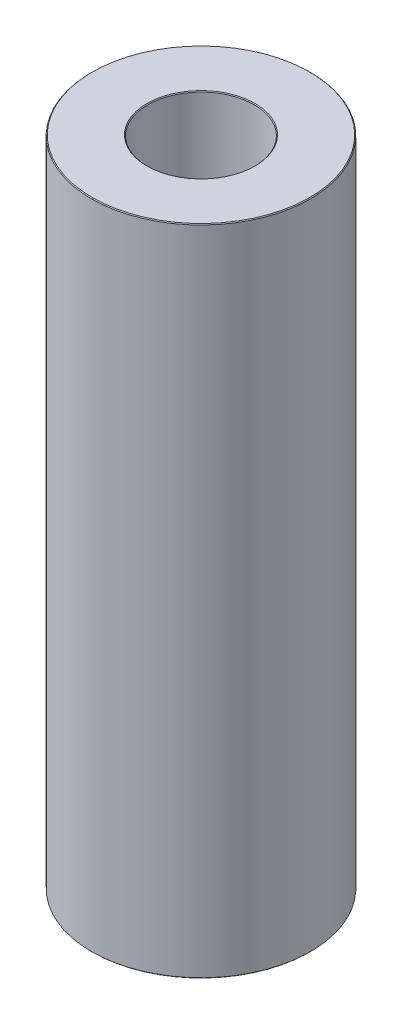
ISO-10303-21;
HEADER;
FILE_DESCRIPTION(('STEP AP214'),'2;1');
FILE_NAME('part.step','',(''),(''),'','','');
FILE_SCHEMA(('AUTOMOTIVE_DESIGN { 1 0 10303 214 1 1 1 1 }'));
ENDSEC;
DATA;
#1=APPLICATION_CONTEXT('core data for automotive mechanical design processes');
#2=APPLICATION_PROTOCOL_DEFINITION('international standard','automotive_design',2000,#1);
#3=PRODUCT_CONTEXT('',#1,'mechanical');
#4=PRODUCT('Part','Part','',(#3));
#5=PRODUCT_RELATED_PRODUCT_CATEGORY('part','',(#4));
#6=PRODUCT_DEFINITION_FORMATION('','',#4);
#7=PRODUCT_DEFINITION_CONTEXT('part definition',#1,'design');
#8=PRODUCT_DEFINITION('design','',#6,#7);
#9=PRODUCT_DEFINITION_SHAPE('','',#8);
#10=(LENGTH_UNIT() NAMED_UNIT(*) SI_UNIT(.MILLI.,.METRE.));
#11=(NAMED_UNIT(*) PLANE_ANGLE_UNIT() SI_UNIT($,.RADIAN.));
#12=(NAMED_UNIT(*) SI_UNIT($,.STERADIAN.) SOLID_ANGLE_UNIT());
#13=UNCERTAINTY_MEASURE_WITH_UNIT(LENGTH_MEASURE(1.E-05),#10,'distance_accuracy_value','');
#14=(GEOMETRIC_REPRESENTATION_CONTEXT(3) GLOBAL_UNCERTAINTY_ASSIGNED_CONTEXT((#13)) GLOBAL_UNIT_ASSIGNED_CONTEXT((#10,
#11,#12)) REPRESENTATION_CONTEXT('',''));
#15=CARTESIAN_POINT('',(0.,0.,0.));
#16=DIRECTION('',(0.,0.,1.));
#17=DIRECTION('',(1.,0.,0.));
#18=AXIS2_PLACEMENT_3D('',#15,#16,#17);
#19=CARTESIAN_POINT('',(0.,298.431814480099,0.));
#20=DIRECTION('',(0.,-1.,0.));
#21=DIRECTION('',(0.,0.,-1.));
#22=AXIS2_PLACEMENT_3D('',#19,#20,#21);
#23=CYLINDRICAL_SURFACE('',#22,50.);
#24=CARTESIAN_POINT('',(0.,0.345083715051486,0.));
#25=DIRECTION('',(0.,1.,0.));
#26=DIRECTION('',(0.,0.,1.));
#27=AXIS2_PLACEMENT_3D('',#24,#25,#26);
#28=CIRCLE('',#27,50.);
#29=CARTESIAN_POINT('',(0.,0.345083715051486,50.));
#30=VERTEX_POINT('',#29);
#31=EDGE_CURVE('E10',#30,#30,#28,.T.);
#32=ORIENTED_EDGE('',*,*,#31,.T.);
#33=EDGE_LOOP('',(#32));
#34=FACE_BOUND('',#33,.T.);
#35=CARTESIAN_POINT('',(0.,298.086730765048,0.));
#36=DIRECTION('',(0.,1.,0.));
#37=DIRECTION('',(0.,0.,1.));
#38=AXIS2_PLACEMENT_3D('',#35,#36,#37);
#39=CIRCLE('',#38,50.);
#40=CARTESIAN_POINT('',(0.,298.086730765048,50.));
#41=VERTEX_POINT('',#40);
#42=EDGE_CURVE('E50',#41,#41,#39,.F.);
#43=ORIENTED_EDGE('',*,*,#42,.T.);
#44=EDGE_LOOP('',(#43));
#45=FACE_BOUND('',#44,.T.);
#46=ADVANCED_FACE('F39',(#34,#45),#23,.T.);
#47=CARTESIAN_POINT('',(0.,298.431814480099,0.));
#48=DIRECTION('',(0.,1.,0.));
#49=DIRECTION('',(0.,0.,1.));
#50=AXIS2_PLACEMENT_3D('',#47,#48,#49);
#51=PLANE('',#50);
#52=CARTESIAN_POINT('',(0.,298.431814480099,0.));
#53=DIRECTION('',(0.,1.,0.));
#54=DIRECTION('',(0.,0.,1.));
#55=AXIS2_PLACEMENT_3D('',#52,#53,#54);
#56=CIRCLE('',#55,24.7235383543607);
#57=CARTESIAN_POINT('',(0.,298.431814480099,24.7235383543607));
#58=VERTEX_POINT('',#57);
#59=EDGE_CURVE('E58',#58,#58,#56,.F.);
#60=ORIENTED_EDGE('',*,*,#59,.T.);
#61=EDGE_LOOP('',(#60));
#62=FACE_BOUND('',#61,.T.);
#63=CARTESIAN_POINT('',(0.,298.431814480099,0.));
#64=DIRECTION('',(0.,1.,0.));
#65=DIRECTION('',(0.,0.,1.));
#66=AXIS2_PLACEMENT_3D('',#63,#64,#65);
#67=CIRCLE('',#66,49.6549162849484);
#68=CARTESIAN_POINT('',(0.,298.431814480099,49.6549162849484));
#69=VERTEX_POINT('',#68);
#70=EDGE_CURVE('E61',#69,#69,#67,.T.);
#71=ORIENTED_EDGE('',*,*,#70,.T.);
#72=EDGE_LOOP('',(#71));
#73=FACE_BOUND('',#72,.T.);
#74=ADVANCED_FACE('F88',(#62,#73),#51,.T.);
#75=CARTESIAN_POINT('',(0.,0.,0.));
#76=DIRECTION('',(0.,1.,0.));
#77=DIRECTION('',(0.,0.,1.));
#78=AXIS2_PLACEMENT_3D('',#75,#76,#77);
#79=PLANE('',#78);
#80=CARTESIAN_POINT('',(0.,0.,0.));
#81=DIRECTION('',(0.,1.,0.));
#82=DIRECTION('',(0.,0.,1.));
#83=AXIS2_PLACEMENT_3D('',#80,#81,#82);
#84=CIRCLE('',#83,24.7235383543607);
#85=CARTESIAN_POINT('',(0.,0.,24.7235383543607));
#86=VERTEX_POINT('',#85);
#87=EDGE_CURVE('E51',#86,#86,#84,.T.);
#88=ORIENTED_EDGE('',*,*,#87,.T.);
#89=EDGE_LOOP('',(#88));
#90=FACE_BOUND('',#89,.T.);
#91=CARTESIAN_POINT('',(0.,0.,0.));
#92=DIRECTION('',(0.,1.,0.));
#93=DIRECTION('',(0.,0.,1.));
#94=AXIS2_PLACEMENT_3D('',#91,#92,#93);
#95=CIRCLE('',#94,49.6549162849485);
#96=CARTESIAN_POINT('',(0.,0.,49.6549162849485));
#97=VERTEX_POINT('',#96);
#98=EDGE_CURVE('E54',#97,#97,#95,.F.);
#99=ORIENTED_EDGE('',*,*,#98,.T.);
#100=EDGE_LOOP('',(#99));
#101=FACE_BOUND('',#100,.T.);
#102=ADVANCED_FACE('F83',(#90,#101),#79,.F.);
#103=CARTESIAN_POINT('',(0.,298.431814480099,0.));
#104=DIRECTION('',(0.,-1.,0.));
#105=DIRECTION('',(0.,0.,-1.));
#106=AXIS2_PLACEMENT_3D('',#103,#104,#105);
#107=CYLINDRICAL_SURFACE('',#106,24.3784546393093);
#108=CARTESIAN_POINT('',(0.,298.086730765048,0.));
#109=DIRECTION('',(0.,1.,0.));
#110=DIRECTION('',(0.,0.,1.));
#111=AXIS2_PLACEMENT_3D('',#108,#109,#110);
#112=CIRCLE('',#111,24.3784546393093);
#113=CARTESIAN_POINT('',(0.,298.086730765048,24.3784546393093));
#114=VERTEX_POINT('',#113);
#115=EDGE_CURVE('E67',#114,#114,#112,.T.);
#116=ORIENTED_EDGE('',*,*,#115,.T.);
#117=EDGE_LOOP('',(#116));
#118=FACE_BOUND('',#117,.T.);
#119=CARTESIAN_POINT('',(0.,0.345083715051486,0.));
#120=DIRECTION('',(0.,1.,0.));
#121=DIRECTION('',(0.,0.,1.));
#122=AXIS2_PLACEMENT_3D('',#119,#120,#121);
#123=CIRCLE('',#122,24.3784546393093);
#124=CARTESIAN_POINT('',(0.,0.345083715051486,24.3784546393093));
#125=VERTEX_POINT('',#124);
#126=EDGE_CURVE('E69',#125,#125,#123,.F.);
#127=ORIENTED_EDGE('',*,*,#126,.T.);
#128=EDGE_LOOP('',(#127));
#129=FACE_BOUND('',#128,.T.);
#130=ADVANCED_FACE('F71',(#118,#129),#107,.F.);
#131=CARTESIAN_POINT('',(0.,298.086730765048,0.));
#132=DIRECTION('',(0.,1.,0.));
#133=DIRECTION('',(0.,0.,1.));
#134=AXIS2_PLACEMENT_3D('',#131,#132,#133);
#135=CONICAL_SURFACE('',#134,24.3784546393093,0.785398163397448);
#136=ORIENTED_EDGE('',*,*,#59,.F.);
#137=EDGE_LOOP('',(#136));
#138=FACE_BOUND('',#137,.T.);
#139=ORIENTED_EDGE('',*,*,#115,.F.);
#140=EDGE_LOOP('',(#139));
#141=FACE_BOUND('',#140,.T.);
#142=ADVANCED_FACE('F77',(#138,#141),#135,.F.);
#143=CARTESIAN_POINT('',(0.,0.,0.));
#144=DIRECTION('',(0.,-1.,0.));
#145=DIRECTION('',(0.,0.,-1.));
#146=AXIS2_PLACEMENT_3D('',#143,#144,#145);
#147=CONICAL_SURFACE('',#146,24.7235383543607,0.785398163397408);
#148=ORIENTED_EDGE('',*,*,#126,.F.);
#149=EDGE_LOOP('',(#148));
#150=FACE_BOUND('',#149,.T.);
#151=ORIENTED_EDGE('',*,*,#87,.F.);
#152=EDGE_LOOP('',(#151));
#153=FACE_BOUND('',#152,.T.);
#154=ADVANCED_FACE('F73',(#150,#153),#147,.F.);
#155=CARTESIAN_POINT('',(0.,0.345083715051486,0.));
#156=DIRECTION('',(0.,1.,0.));
#157=DIRECTION('',(0.,0.,1.));
#158=AXIS2_PLACEMENT_3D('',#155,#156,#157);
#159=CONICAL_SURFACE('',#158,50.,0.785398163397499);
#160=ORIENTED_EDGE('',*,*,#98,.F.);
#161=EDGE_LOOP('',(#160));
#162=FACE_BOUND('',#161,.T.);
#163=ORIENTED_EDGE('',*,*,#31,.F.);
#164=EDGE_LOOP('',(#163));
#165=FACE_BOUND('',#164,.T.);
#166=ADVANCED_FACE('F76',(#162,#165),#159,.T.);
#167=CARTESIAN_POINT('',(0.,298.431814480099,0.));
#168=DIRECTION('',(0.,-1.,0.));
#169=DIRECTION('',(0.,0.,-1.));
#170=AXIS2_PLACEMENT_3D('',#167,#168,#169);
#171=CONICAL_SURFACE('',#170,49.6549162849484,0.785398163397468);
#172=ORIENTED_EDGE('',*,*,#42,.F.);
#173=EDGE_LOOP('',(#172));
#174=FACE_BOUND('',#173,.T.);
#175=ORIENTED_EDGE('',*,*,#70,.F.);
#176=EDGE_LOOP('',(#175));
#177=FACE_BOUND('',#176,.T.);
#178=ADVANCED_FACE('F45',(#174,#177),#171,.T.);
#179=CLOSED_SHELL('',(#46,#74,#102,#130,#142,#154,#166,#178));
#180=MANIFOLD_SOLID_BREP('B2',#179);
#181=ADVANCED_BREP_SHAPE_REPRESENTATION('',(#18,#180),#14);
#182=SHAPE_DEFINITION_REPRESENTATION(#9,#181);
ENDSEC;
END-ISO-10303-21;
